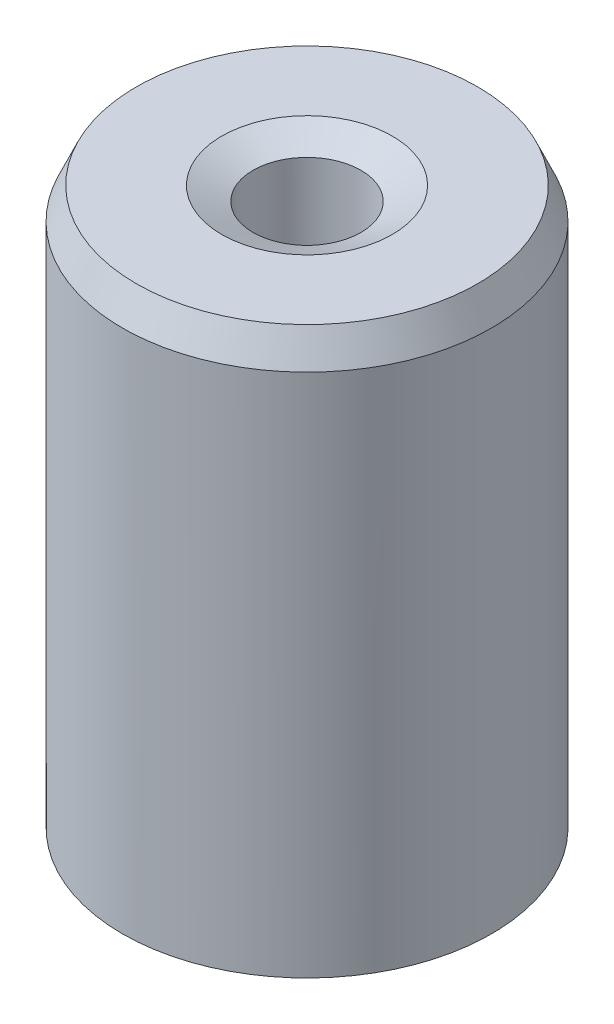
ISO-10303-21;
HEADER;
FILE_DESCRIPTION(('STEP AP214'),'2;1');
FILE_NAME('part.step','',(''),(''),'','','');
FILE_SCHEMA(('AUTOMOTIVE_DESIGN { 1 0 10303 214 1 1 1 1 }'));
ENDSEC;
DATA;
#1=APPLICATION_CONTEXT('core data for automotive mechanical design processes');
#2=APPLICATION_PROTOCOL_DEFINITION('international standard','automotive_design',2000,#1);
#3=PRODUCT_CONTEXT('',#1,'mechanical');
#4=PRODUCT('Part','Part','',(#3));
#5=PRODUCT_RELATED_PRODUCT_CATEGORY('part','',(#4));
#6=PRODUCT_DEFINITION_FORMATION('','',#4);
#7=PRODUCT_DEFINITION_CONTEXT('part definition',#1,'design');
#8=PRODUCT_DEFINITION('design','',#6,#7);
#9=PRODUCT_DEFINITION_SHAPE('','',#8);
#10=(LENGTH_UNIT() NAMED_UNIT(*) SI_UNIT(.MILLI.,.METRE.));
#11=(NAMED_UNIT(*) PLANE_ANGLE_UNIT() SI_UNIT($,.RADIAN.));
#12=(NAMED_UNIT(*) SI_UNIT($,.STERADIAN.) SOLID_ANGLE_UNIT());
#13=UNCERTAINTY_MEASURE_WITH_UNIT(LENGTH_MEASURE(1.E-05),#10,'distance_accuracy_value','');
#14=(GEOMETRIC_REPRESENTATION_CONTEXT(3) GLOBAL_UNCERTAINTY_ASSIGNED_CONTEXT((#13)) GLOBAL_UNIT_ASSIGNED_CONTEXT((#10,
#11,#12)) REPRESENTATION_CONTEXT('',''));
#15=CARTESIAN_POINT('',(0.,0.,0.));
#16=DIRECTION('',(0.,0.,1.));
#17=DIRECTION('',(1.,0.,0.));
#18=AXIS2_PLACEMENT_3D('',#15,#16,#17);
#19=CARTESIAN_POINT('',(0.,15.4420190229167,0.));
#20=DIRECTION('',(0.,-1.,0.));
#21=DIRECTION('',(0.,0.,-1.));
#22=AXIS2_PLACEMENT_3D('',#19,#20,#21);
#23=CYLINDRICAL_SURFACE('',#22,5.);
#24=CARTESIAN_POINT('',(0.,0.377486933301757,0.));
#25=DIRECTION('',(0.,1.,0.));
#26=DIRECTION('',(0.,0.,1.));
#27=AXIS2_PLACEMENT_3D('',#24,#25,#26);
#28=CIRCLE('',#27,5.);
#29=CARTESIAN_POINT('',(0.,0.377486933301757,-5.));
#30=VERTEX_POINT('',#29);
#31=EDGE_CURVE('E10',#30,#30,#28,.T.);
#32=CARTESIAN_POINT('',(0.,14.5920542033684,0.));
#33=DIRECTION('',(0.,1.,0.));
#34=DIRECTION('',(0.,0.,1.));
#35=AXIS2_PLACEMENT_3D('',#32,#33,#34);
#36=CIRCLE('',#35,5.);
#37=CARTESIAN_POINT('',(0.,14.5920542033684,-5.));
#38=VERTEX_POINT('',#37);
#39=EDGE_CURVE('E50',#38,#38,#36,.F.);
#40=CARTESIAN_POINT('',(0.,0.377486933301757,-5.));
#41=CARTESIAN_POINT('',(0.,0.525555342364951,-5.));
#42=CARTESIAN_POINT('',(0.,0.673623751428145,-5.));
#43=CARTESIAN_POINT('',(0.,0.969760569554534,-5.));
#44=CARTESIAN_POINT('',(0.,1.11782897861773,-5.));
#45=CARTESIAN_POINT('',(0.,1.41396579674412,-5.));
#46=CARTESIAN_POINT('',(0.,1.56203420580731,-5.));
#47=CARTESIAN_POINT('',(0.,1.8581710239337,-5.));
#48=CARTESIAN_POINT('',(0.,2.0062394329969,-5.));
#49=CARTESIAN_POINT('',(0.,2.30237625112329,-5.));
#50=CARTESIAN_POINT('',(0.,2.45044466018648,-5.));
#51=CARTESIAN_POINT('',(0.,2.74658147831287,-5.));
#52=CARTESIAN_POINT('',(0.,2.89464988737606,-5.));
#53=CARTESIAN_POINT('',(0.,3.19078670550245,-5.));
#54=CARTESIAN_POINT('',(0.,3.33885511456565,-5.));
#55=CARTESIAN_POINT('',(0.,3.63499193269204,-5.));
#56=CARTESIAN_POINT('',(0.,3.78306034175523,-5.));
#57=CARTESIAN_POINT('',(0.,4.07919715988162,-5.));
#58=CARTESIAN_POINT('',(0.,4.22726556894481,-5.));
#59=CARTESIAN_POINT('',(0.,4.5234023870712,-5.));
#60=CARTESIAN_POINT('',(0.,4.6714707961344,-5.));
#61=CARTESIAN_POINT('',(0.,4.96760761426079,-5.));
#62=CARTESIAN_POINT('',(0.,5.11567602332398,-5.));
#63=CARTESIAN_POINT('',(0.,5.41181284145037,-5.));
#64=CARTESIAN_POINT('',(0.,5.55988125051356,-5.));
#65=CARTESIAN_POINT('',(0.,5.85601806863995,-5.));
#66=CARTESIAN_POINT('',(0.,6.00408647770315,-5.));
#67=CARTESIAN_POINT('',(0.,6.30022329582954,-5.));
#68=CARTESIAN_POINT('',(0.,6.44829170489273,-5.));
#69=CARTESIAN_POINT('',(0.,6.74442852301912,-5.));
#70=CARTESIAN_POINT('',(0.,6.89249693208231,-5.));
#71=CARTESIAN_POINT('',(0.,7.18863375020871,-5.));
#72=CARTESIAN_POINT('',(0.,7.3367021592719,-5.));
#73=CARTESIAN_POINT('',(0.,7.63283897739829,-5.));
#74=CARTESIAN_POINT('',(0.,7.78090738646148,-5.));
#75=CARTESIAN_POINT('',(0.,8.07704420458787,-5.));
#76=CARTESIAN_POINT('',(0.,8.22511261365106,-5.));
#77=CARTESIAN_POINT('',(0.,8.52124943177745,-5.));
#78=CARTESIAN_POINT('',(0.,8.66931784084065,-5.));
#79=CARTESIAN_POINT('',(0.,8.96545465896704,-5.));
#80=CARTESIAN_POINT('',(0.,9.11352306803023,-5.));
#81=CARTESIAN_POINT('',(0.,9.40965988615662,-5.));
#82=CARTESIAN_POINT('',(0.,9.55772829521982,-5.));
#83=CARTESIAN_POINT('',(0.,9.8538651133462,-5.));
#84=CARTESIAN_POINT('',(0.,10.0019335224094,-5.));
#85=CARTESIAN_POINT('',(0.,10.2980703405358,-5.));
#86=CARTESIAN_POINT('',(0.,10.446138749599,-5.));
#87=CARTESIAN_POINT('',(0.,10.7422755677254,-5.));
#88=CARTESIAN_POINT('',(0.,10.8903439767886,-5.));
#89=CARTESIAN_POINT('',(0.,11.186480794915,-5.));
#90=CARTESIAN_POINT('',(0.,11.3345492039781,-5.));
#91=CARTESIAN_POINT('',(0.,11.6306860221045,-5.));
#92=CARTESIAN_POINT('',(0.,11.7787544311677,-5.));
#93=CARTESIAN_POINT('',(0.,12.0748912492941,-5.));
#94=CARTESIAN_POINT('',(0.,12.2229596583573,-5.));
#95=CARTESIAN_POINT('',(0.,12.5190964764837,-5.));
#96=CARTESIAN_POINT('',(0.,12.6671648855469,-5.));
#97=CARTESIAN_POINT('',(0.,12.9633017036733,-5.));
#98=CARTESIAN_POINT('',(0.,13.1113701127365,-5.));
#99=CARTESIAN_POINT('',(0.,13.4075069308629,-5.));
#100=CARTESIAN_POINT('',(0.,13.5555753399261,-5.));
#101=CARTESIAN_POINT('',(0.,13.8517121580525,-5.));
#102=CARTESIAN_POINT('',(0.,13.9997805671157,-5.));
#103=CARTESIAN_POINT('',(0.,14.295917385242,-5.));
#104=CARTESIAN_POINT('',(0.,14.4439857943052,-5.));
#105=CARTESIAN_POINT('',(0.,14.5920542033684,-5.));
#106=B_SPLINE_CURVE_WITH_KNOTS('',3,(#40,#41,#42,#43,#44,#45,#46,#47,#48,#49,#50,#51,#52,#53,
#54,#55,#56,#57,#58,#59,#60,#61,#62,#63,#64,#65,#66,#67,#68,#69,#70,#71,#72,#73,#74,#75,#76,#77,
#78,#79,#80,#81,#82,#83,#84,#85,#86,#87,#88,#89,#90,#91,#92,#93,#94,#95,#96,#97,#98,#99,#100,
#101,#102,#103,#104,#105),.UNSPECIFIED.,.F.,.F.,(4,2,2,2,2,2,2,2,2,2,2,2,2,2,2,2,2,2,2,2,2,2,2,
2,2,2,2,2,2,2,2,2,4),(0.,0.444205227189583,0.888410454379167,1.33261568156875,1.77682090875833,
2.22102613594792,2.6652313631375,3.10943659032708,3.55364181751667,3.99784704470625,
4.44205227189583,4.88625749908542,5.330462726275,5.77466795346459,6.21887318065417,
6.66307840784375,7.10728363503334,7.55148886222292,7.9956940894125,8.43989931660209,
8.88410454379167,9.32830977098125,9.77251499817084,10.2167202253604,10.66092545255,
11.1051306797396,11.5493359069292,11.9935411341188,12.4377463613083,12.8819515884979,
13.3261568156875,13.7703620428771,14.2145672700667),.UNSPECIFIED.);
#107=EDGE_CURVE('BSEAM39',#30,#38,#106,.T.);
#108=ORIENTED_EDGE('',*,*,#31,.T.);
#109=ORIENTED_EDGE('',*,*,#39,.T.);
#110=ORIENTED_EDGE('',*,*,#107,.T.);
#111=ORIENTED_EDGE('',*,*,#107,.F.);
#112=EDGE_LOOP('',(#108,#110,#109,#111));
#113=FACE_BOUND('',#112,.T.);
#114=ADVANCED_FACE('F39',(#113),#23,.T.);
#115=CARTESIAN_POINT('',(0.,15.4420190229167,0.));
#116=DIRECTION('',(0.,1.,0.));
#117=DIRECTION('',(0.,0.,1.));
#118=AXIS2_PLACEMENT_3D('',#115,#116,#117);
#119=PLANE('',#118);
#120=CARTESIAN_POINT('',(0.,15.4420190229167,0.));
#121=DIRECTION('',(0.,1.,0.));
#122=DIRECTION('',(0.,0.,1.));
#123=AXIS2_PLACEMENT_3D('',#120,#121,#122);
#124=CIRCLE('',#123,2.31051413661688);
#125=CARTESIAN_POINT('',(0.,15.4420190229167,2.31051413661688));
#126=VERTEX_POINT('',#125);
#127=EDGE_CURVE('E58',#126,#126,#124,.F.);
#128=ORIENTED_EDGE('',*,*,#127,.T.);
#129=EDGE_LOOP('',(#128));
#130=FACE_BOUND('',#129,.T.);
#131=CARTESIAN_POINT('',(0.,15.4420190229167,0.));
#132=DIRECTION('',(0.,1.,0.));
#133=DIRECTION('',(0.,0.,1.));
#134=AXIS2_PLACEMENT_3D('',#131,#132,#133);
#135=CIRCLE('',#134,4.62251306669827);
#136=CARTESIAN_POINT('',(0.,15.4420190229167,4.62251306669827));
#137=VERTEX_POINT('',#136);
#138=EDGE_CURVE('E61',#137,#137,#135,.T.);
#139=ORIENTED_EDGE('',*,*,#138,.T.);
#140=EDGE_LOOP('',(#139));
#141=FACE_BOUND('',#140,.T.);
#142=ADVANCED_FACE('F88',(#130,#141),#119,.T.);
#143=CARTESIAN_POINT('',(0.,0.,0.));
#144=DIRECTION('',(0.,1.,0.));
#145=DIRECTION('',(0.,0.,1.));
#146=AXIS2_PLACEMENT_3D('',#143,#144,#145);
#147=PLANE('',#146);
#148=CARTESIAN_POINT('',(0.,0.,0.));
#149=DIRECTION('',(0.,1.,0.));
#150=DIRECTION('',(0.,0.,1.));
#151=AXIS2_PLACEMENT_3D('',#148,#149,#150);
#152=CIRCLE('',#151,1.83803625037026);
#153=CARTESIAN_POINT('',(0.,0.,1.83803625037026));
#154=VERTEX_POINT('',#153);
#155=EDGE_CURVE('E51',#154,#154,#152,.T.);
#156=ORIENTED_EDGE('',*,*,#155,.T.);
#157=EDGE_LOOP('',(#156));
#158=FACE_BOUND('',#157,.T.);
#159=CARTESIAN_POINT('',(0.,0.,0.));
#160=DIRECTION('',(0.,1.,0.));
#161=DIRECTION('',(0.,0.,1.));
#162=AXIS2_PLACEMENT_3D('',#159,#160,#161);
#163=CIRCLE('',#162,4.15003518045164);
#164=CARTESIAN_POINT('',(0.,0.,4.15003518045164));
#165=VERTEX_POINT('',#164);
#166=EDGE_CURVE('E54',#165,#165,#163,.F.);
#167=ORIENTED_EDGE('',*,*,#166,.T.);
#168=EDGE_LOOP('',(#167));
#169=FACE_BOUND('',#168,.T.);
#170=ADVANCED_FACE('F83',(#158,#169),#147,.F.);
#171=CARTESIAN_POINT('',(0.,15.4420190229167,0.));
#172=DIRECTION('',(0.,-1.,0.));
#173=DIRECTION('',(0.,0.,-1.));
#174=AXIS2_PLACEMENT_3D('',#171,#172,#173);
#175=CYLINDRICAL_SURFACE('',#174,1.46054931706851);
#176=CARTESIAN_POINT('',(0.,15.064532089615,0.));
#177=DIRECTION('',(0.,1.,0.));
#178=DIRECTION('',(0.,0.,1.));
#179=AXIS2_PLACEMENT_3D('',#176,#177,#178);
#180=CIRCLE('',#179,1.46054931706851);
#181=CARTESIAN_POINT('',(0.,15.064532089615,-1.46054931706851));
#182=VERTEX_POINT('',#181);
#183=EDGE_CURVE('E67',#182,#182,#180,.T.);
#184=CARTESIAN_POINT('',(0.,0.849964819548346,0.));
#185=DIRECTION('',(0.,1.,0.));
#186=DIRECTION('',(0.,0.,1.));
#187=AXIS2_PLACEMENT_3D('',#184,#185,#186);
#188=CIRCLE('',#187,1.46054931706851);
#189=CARTESIAN_POINT('',(0.,0.849964819548346,-1.46054931706851));
#190=VERTEX_POINT('',#189);
#191=EDGE_CURVE('E69',#190,#190,#188,.F.);
#192=CARTESIAN_POINT('',(0.,15.064532089615,-1.46054931706851));
#193=CARTESIAN_POINT('',(0.,14.9164636805518,-1.46054931706851));
#194=CARTESIAN_POINT('',(0.,14.7683952714886,-1.46054931706851));
#195=CARTESIAN_POINT('',(0.,14.4722584533622,-1.46054931706851));
#196=CARTESIAN_POINT('',(0.,14.324190044299,-1.46054931706851));
#197=CARTESIAN_POINT('',(0.,14.0280532261726,-1.46054931706851));
#198=CARTESIAN_POINT('',(0.,13.8799848171094,-1.46054931706851));
#199=CARTESIAN_POINT('',(0.,13.583847998983,-1.46054931706851));
#200=CARTESIAN_POINT('',(0.,13.4357795899198,-1.46054931706851));
#201=CARTESIAN_POINT('',(0.,13.1396427717935,-1.46054931706851));
#202=CARTESIAN_POINT('',(0.,12.9915743627303,-1.46054931706851));
#203=CARTESIAN_POINT('',(0.,12.6954375446039,-1.46054931706851));
#204=CARTESIAN_POINT('',(0.,12.5473691355407,-1.46054931706851));
#205=CARTESIAN_POINT('',(0.,12.2512323174143,-1.46054931706851));
#206=CARTESIAN_POINT('',(0.,12.1031639083511,-1.46054931706851));
#207=CARTESIAN_POINT('',(0.,11.8070270902247,-1.46054931706851));
#208=CARTESIAN_POINT('',(0.,11.6589586811615,-1.46054931706851));
#209=CARTESIAN_POINT('',(0.,11.3628218630351,-1.46054931706851));
#210=CARTESIAN_POINT('',(0.,11.2147534539719,-1.46054931706851));
#211=CARTESIAN_POINT('',(0.,10.9186166358455,-1.46054931706851));
#212=CARTESIAN_POINT('',(0.,10.7705482267823,-1.46054931706851));
#213=CARTESIAN_POINT('',(0.,10.474411408656,-1.46054931706851));
#214=CARTESIAN_POINT('',(0.,10.3263429995928,-1.46054931706851));
#215=CARTESIAN_POINT('',(0.,10.0302061814664,-1.46054931706851));
#216=CARTESIAN_POINT('',(0.,9.88213777240318,-1.46054931706851));
#217=CARTESIAN_POINT('',(0.,9.58600095427679,-1.46054931706851));
#218=CARTESIAN_POINT('',(0.,9.4379325452136,-1.46054931706851));
#219=CARTESIAN_POINT('',(0.,9.14179572708721,-1.46054931706851));
#220=CARTESIAN_POINT('',(0.,8.99372731802402,-1.46054931706851));
#221=CARTESIAN_POINT('',(0.,8.69759049989763,-1.46054931706851));
#222=CARTESIAN_POINT('',(0.,8.54952209083444,-1.46054931706851));
#223=CARTESIAN_POINT('',(0.,8.25338527270805,-1.46054931706851));
#224=CARTESIAN_POINT('',(0.,8.10531686364486,-1.46054931706851));
#225=CARTESIAN_POINT('',(0.,7.80918004551847,-1.46054931706851));
#226=CARTESIAN_POINT('',(0.,7.66111163645527,-1.46054931706851));
#227=CARTESIAN_POINT('',(0.,7.36497481832888,-1.46054931706851));
#228=CARTESIAN_POINT('',(0.,7.21690640926569,-1.46054931706851));
#229=CARTESIAN_POINT('',(0.,6.9207695911393,-1.46054931706851));
#230=CARTESIAN_POINT('',(0.,6.77270118207611,-1.46054931706851));
#231=CARTESIAN_POINT('',(0.,6.47656436394972,-1.46054931706851));
#232=CARTESIAN_POINT('',(0.,6.32849595488653,-1.46054931706851));
#233=CARTESIAN_POINT('',(0.,6.03235913676014,-1.46054931706851));
#234=CARTESIAN_POINT('',(0.,5.88429072769694,-1.46054931706851));
#235=CARTESIAN_POINT('',(0.,5.58815390957056,-1.46054931706851));
#236=CARTESIAN_POINT('',(0.,5.44008550050736,-1.46054931706851));
#237=CARTESIAN_POINT('',(0.,5.14394868238097,-1.46054931706851));
#238=CARTESIAN_POINT('',(0.,4.99588027331778,-1.46054931706851));
#239=CARTESIAN_POINT('',(0.,4.69974345519139,-1.46054931706851));
#240=CARTESIAN_POINT('',(0.,4.5516750461282,-1.46054931706851));
#241=CARTESIAN_POINT('',(0.,4.25553822800181,-1.46054931706851));
#242=CARTESIAN_POINT('',(0.,4.10746981893861,-1.46054931706851));
#243=CARTESIAN_POINT('',(0.,3.81133300081223,-1.46054931706851));
#244=CARTESIAN_POINT('',(0.,3.66326459174903,-1.46054931706851));
#245=CARTESIAN_POINT('',(0.,3.36712777362264,-1.46054931706851));
#246=CARTESIAN_POINT('',(0.,3.21905936455945,-1.46054931706851));
#247=CARTESIAN_POINT('',(0.,2.92292254643306,-1.46054931706851));
#248=CARTESIAN_POINT('',(0.,2.77485413736987,-1.46054931706851));
#249=CARTESIAN_POINT('',(0.,2.47871731924348,-1.46054931706851));
#250=CARTESIAN_POINT('',(0.,2.33064891018029,-1.46054931706851));
#251=CARTESIAN_POINT('',(0.,2.0345120920539,-1.46054931706851));
#252=CARTESIAN_POINT('',(0.,1.8864436829907,-1.46054931706851));
#253=CARTESIAN_POINT('',(0.,1.59030686486432,-1.46054931706851));
#254=CARTESIAN_POINT('',(0.,1.44223845580112,-1.46054931706851));
#255=CARTESIAN_POINT('',(0.,1.14610163767473,-1.46054931706851));
#256=CARTESIAN_POINT('',(0.,0.99803322861154,-1.46054931706851));
#257=CARTESIAN_POINT('',(0.,0.849964819548346,-1.46054931706851));
#258=B_SPLINE_CURVE_WITH_KNOTS('',3,(#192,#193,#194,#195,#196,#197,#198,#199,#200,#201,#202,
#203,#204,#205,#206,#207,#208,#209,#210,#211,#212,#213,#214,#215,#216,#217,#218,#219,#220,#221,
#222,#223,#224,#225,#226,#227,#228,#229,#230,#231,#232,#233,#234,#235,#236,#237,#238,#239,#240,
#241,#242,#243,#244,#245,#246,#247,#248,#249,#250,#251,#252,#253,#254,#255,#256,#257),
.UNSPECIFIED.,.F.,.F.,(4,2,2,2,2,2,2,2,2,2,2,2,2,2,2,2,2,2,2,2,2,2,2,2,2,2,2,2,2,2,2,2,4),(0.,
0.444205227189581,0.888410454379164,1.33261568156874,1.77682090875833,2.22102613594791,
2.66523136313749,3.10943659032707,3.55364181751666,3.99784704470624,4.44205227189582,
4.8862574990854,5.33046272627498,5.77466795346457,6.21887318065415,6.66307840784373,
7.10728363503331,7.55148886222289,7.99569408941248,8.43989931660206,8.88410454379164,
9.32830977098122,9.7725149981708,10.2167202253604,10.66092545255,11.1051306797396,
11.5493359069291,11.9935411341187,12.4377463613083,12.8819515884979,13.3261568156875,
13.770362042877,14.2145672700666),.UNSPECIFIED.);
#259=EDGE_CURVE('BSEAM71',#182,#190,#258,.T.);
#260=ORIENTED_EDGE('',*,*,#183,.T.);
#261=ORIENTED_EDGE('',*,*,#191,.T.);
#262=ORIENTED_EDGE('',*,*,#259,.T.);
#263=ORIENTED_EDGE('',*,*,#259,.F.);
#264=EDGE_LOOP('',(#260,#262,#261,#263));
#265=FACE_BOUND('',#264,.T.);
#266=ADVANCED_FACE('F71',(#265),#175,.F.);
#267=CARTESIAN_POINT('',(0.,15.064532089615,0.));
#268=DIRECTION('',(0.,1.,0.));
#269=DIRECTION('',(0.,0.,1.));
#270=AXIS2_PLACEMENT_3D('',#267,#268,#269);
#271=CONICAL_SURFACE('',#270,1.46054931706851,1.15284240967964);
#272=ORIENTED_EDGE('',*,*,#127,.F.);
#273=EDGE_LOOP('',(#272));
#274=FACE_BOUND('',#273,.T.);
#275=ORIENTED_EDGE('',*,*,#183,.F.);
#276=EDGE_LOOP('',(#275));
#277=FACE_BOUND('',#276,.T.);
#278=ADVANCED_FACE('F77',(#274,#277),#271,.F.);
#279=CARTESIAN_POINT('',(0.,0.,0.));
#280=DIRECTION('',(0.,-1.,0.));
#281=DIRECTION('',(0.,0.,-1.));
#282=AXIS2_PLACEMENT_3D('',#279,#280,#281);
#283=CONICAL_SURFACE('',#282,1.83803625037026,0.417953917115257);
#284=ORIENTED_EDGE('',*,*,#191,.F.);
#285=EDGE_LOOP('',(#284));
#286=FACE_BOUND('',#285,.T.);
#287=ORIENTED_EDGE('',*,*,#155,.F.);
#288=EDGE_LOOP('',(#287));
#289=FACE_BOUND('',#288,.T.);
#290=ADVANCED_FACE('F73',(#286,#289),#283,.F.);
#291=CARTESIAN_POINT('',(0.,0.377486933301757,0.));
#292=DIRECTION('',(0.,1.,0.));
#293=DIRECTION('',(0.,0.,1.));
#294=AXIS2_PLACEMENT_3D('',#291,#292,#293);
#295=CONICAL_SURFACE('',#294,5.,1.15284240967964);
#296=ORIENTED_EDGE('',*,*,#166,.F.);
#297=EDGE_LOOP('',(#296));
#298=FACE_BOUND('',#297,.T.);
#299=ORIENTED_EDGE('',*,*,#31,.F.);
#300=EDGE_LOOP('',(#299));
#301=FACE_BOUND('',#300,.T.);
#302=ADVANCED_FACE('F76',(#298,#301),#295,.T.);
#303=CARTESIAN_POINT('',(0.,15.4420190229167,0.));
#304=DIRECTION('',(0.,-1.,0.));
#305=DIRECTION('',(0.,0.,-1.));
#306=AXIS2_PLACEMENT_3D('',#303,#304,#305);
#307=CONICAL_SURFACE('',#306,4.62251306669827,0.417953917115261);
#308=ORIENTED_EDGE('',*,*,#39,.F.);
#309=EDGE_LOOP('',(#308));
#310=FACE_BOUND('',#309,.T.);
#311=ORIENTED_EDGE('',*,*,#138,.F.);
#312=EDGE_LOOP('',(#311));
#313=FACE_BOUND('',#312,.T.);
#314=ADVANCED_FACE('F45',(#310,#313),#307,.T.);
#315=CLOSED_SHELL('',(#114,#142,#170,#266,#278,#290,#302,#314));
#316=MANIFOLD_SOLID_BREP('B2',#315);
#317=ADVANCED_BREP_SHAPE_REPRESENTATION('',(#18,#316),#14);
#318=SHAPE_DEFINITION_REPRESENTATION(#9,#317);
ENDSEC;
END-ISO-10303-21;
